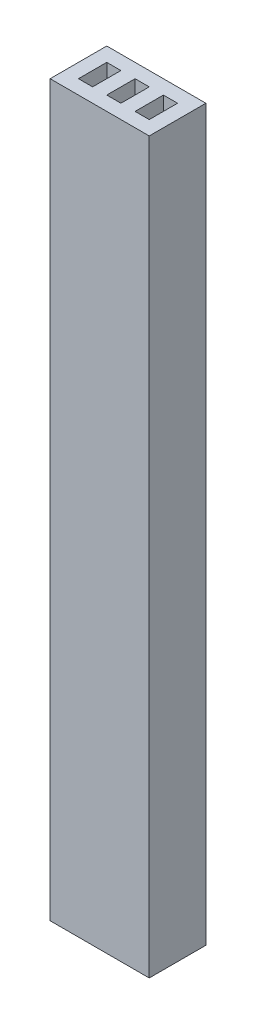
ISO-10303-21;
HEADER;
FILE_DESCRIPTION(('STEP AP214'),'2;1');
FILE_NAME('part.step','',(''),(''),'','','');
FILE_SCHEMA(('AUTOMOTIVE_DESIGN { 1 0 10303 214 1 1 1 1 }'));
ENDSEC;
DATA;
#1=APPLICATION_CONTEXT('core data for automotive mechanical design processes');
#2=APPLICATION_PROTOCOL_DEFINITION('international standard','automotive_design',2000,#1);
#3=PRODUCT_CONTEXT('',#1,'mechanical');
#4=PRODUCT('Part','Part','',(#3));
#5=PRODUCT_RELATED_PRODUCT_CATEGORY('part','',(#4));
#6=PRODUCT_DEFINITION_FORMATION('','',#4);
#7=PRODUCT_DEFINITION_CONTEXT('part definition',#1,'design');
#8=PRODUCT_DEFINITION('design','',#6,#7);
#9=PRODUCT_DEFINITION_SHAPE('','',#8);
#10=(LENGTH_UNIT() NAMED_UNIT(*) SI_UNIT(.MILLI.,.METRE.));
#11=(NAMED_UNIT(*) PLANE_ANGLE_UNIT() SI_UNIT($,.RADIAN.));
#12=(NAMED_UNIT(*) SI_UNIT($,.STERADIAN.) SOLID_ANGLE_UNIT());
#13=UNCERTAINTY_MEASURE_WITH_UNIT(LENGTH_MEASURE(1.E-05),#10,'distance_accuracy_value','');
#14=(GEOMETRIC_REPRESENTATION_CONTEXT(3) GLOBAL_UNCERTAINTY_ASSIGNED_CONTEXT((#13)) GLOBAL_UNIT_ASSIGNED_CONTEXT((#10,
#11,#12)) REPRESENTATION_CONTEXT('',''));
#15=CARTESIAN_POINT('',(0.,0.,0.));
#16=DIRECTION('',(0.,0.,1.));
#17=DIRECTION('',(1.,0.,0.));
#18=AXIS2_PLACEMENT_3D('',#15,#16,#17);
#19=CARTESIAN_POINT('',(0.,51.5,0.));
#20=DIRECTION('',(0.,1.,0.));
#21=DIRECTION('',(0.,0.,1.));
#22=AXIS2_PLACEMENT_3D('',#19,#20,#21);
#23=PLANE('',#22);
#24=DIRECTION('',(0.,0.,-1.));
#25=VECTOR('',#24,1.);
#26=CARTESIAN_POINT('',(6.,51.5,-3.));
#27=LINE('',#26,#25);
#28=CARTESIAN_POINT('',(6.,51.5,1.));
#29=VERTEX_POINT('',#28);
#30=CARTESIAN_POINT('',(6.,51.5,-3.));
#31=VERTEX_POINT('',#30);
#32=EDGE_CURVE('E244',#29,#31,#27,.T.);
#33=ORIENTED_EDGE('',*,*,#32,.T.);
#34=DIRECTION('',(-1.,0.,0.));
#35=VECTOR('',#34,1.);
#36=CARTESIAN_POINT('',(-1.,51.5,-3.));
#37=LINE('',#36,#35);
#38=CARTESIAN_POINT('',(-1.,51.5,-3.));
#39=VERTEX_POINT('',#38);
#40=EDGE_CURVE('E247',#31,#39,#37,.T.);
#41=ORIENTED_EDGE('',*,*,#40,.T.);
#42=DIRECTION('',(0.,0.,1.));
#43=VECTOR('',#42,1.);
#44=CARTESIAN_POINT('',(-1.,51.5,-3.));
#45=LINE('',#44,#43);
#46=CARTESIAN_POINT('',(-1.,51.5,1.));
#47=VERTEX_POINT('',#46);
#48=EDGE_CURVE('E250',#39,#47,#45,.T.);
#49=ORIENTED_EDGE('',*,*,#48,.T.);
#50=DIRECTION('',(1.,0.,0.));
#51=VECTOR('',#50,1.);
#52=CARTESIAN_POINT('',(-1.,51.5,1.));
#53=LINE('',#52,#51);
#54=EDGE_CURVE('E252',#47,#29,#53,.T.);
#55=ORIENTED_EDGE('',*,*,#54,.T.);
#56=EDGE_LOOP('',(#33,#41,#49,#55));
#57=FACE_BOUND('',#56,.T.);
#58=DIRECTION('',(1.,0.,0.));
#59=VECTOR('',#58,1.);
#60=CARTESIAN_POINT('',(0.,51.5,0.));
#61=LINE('',#60,#59);
#62=CARTESIAN_POINT('',(0.,51.5,0.));
#63=VERTEX_POINT('',#62);
#64=CARTESIAN_POINT('',(1.,51.5,0.));
#65=VERTEX_POINT('',#64);
#66=EDGE_CURVE('E215',#63,#65,#61,.T.);
#67=ORIENTED_EDGE('',*,*,#66,.F.);
#68=DIRECTION('',(0.,0.,1.));
#69=VECTOR('',#68,1.);
#70=CARTESIAN_POINT('',(0.,51.5,0.));
#71=LINE('',#70,#69);
#72=CARTESIAN_POINT('',(0.,51.5,-2.));
#73=VERTEX_POINT('',#72);
#74=EDGE_CURVE('E213',#73,#63,#71,.T.);
#75=ORIENTED_EDGE('',*,*,#74,.F.);
#76=DIRECTION('',(-1.,0.,0.));
#77=VECTOR('',#76,1.);
#78=CARTESIAN_POINT('',(0.,51.5,-2.));
#79=LINE('',#78,#77);
#80=CARTESIAN_POINT('',(1.,51.5,-2.));
#81=VERTEX_POINT('',#80);
#82=EDGE_CURVE('E221',#81,#73,#79,.T.);
#83=ORIENTED_EDGE('',*,*,#82,.F.);
#84=DIRECTION('',(0.,0.,-1.));
#85=VECTOR('',#84,1.);
#86=CARTESIAN_POINT('',(1.,51.5,0.));
#87=LINE('',#86,#85);
#88=EDGE_CURVE('E218',#65,#81,#87,.T.);
#89=ORIENTED_EDGE('',*,*,#88,.F.);
#90=EDGE_LOOP('',(#67,#75,#83,#89));
#91=FACE_BOUND('',#90,.T.);
#92=DIRECTION('',(-1.,0.,0.));
#93=VECTOR('',#92,1.);
#94=CARTESIAN_POINT('',(2.,51.5,-2.));
#95=LINE('',#94,#93);
#96=CARTESIAN_POINT('',(3.,51.5,-2.));
#97=VERTEX_POINT('',#96);
#98=CARTESIAN_POINT('',(2.,51.5,-2.));
#99=VERTEX_POINT('',#98);
#100=EDGE_CURVE('E184',#97,#99,#95,.T.);
#101=ORIENTED_EDGE('',*,*,#100,.F.);
#102=DIRECTION('',(0.,0.,-1.));
#103=VECTOR('',#102,1.);
#104=CARTESIAN_POINT('',(3.,51.5,0.));
#105=LINE('',#104,#103);
#106=CARTESIAN_POINT('',(3.,51.5,0.));
#107=VERTEX_POINT('',#106);
#108=EDGE_CURVE('E182',#107,#97,#105,.T.);
#109=ORIENTED_EDGE('',*,*,#108,.F.);
#110=DIRECTION('',(1.,0.,0.));
#111=VECTOR('',#110,1.);
#112=CARTESIAN_POINT('',(2.,51.5,0.));
#113=LINE('',#112,#111);
#114=CARTESIAN_POINT('',(2.,51.5,0.));
#115=VERTEX_POINT('',#114);
#116=EDGE_CURVE('E190',#115,#107,#113,.T.);
#117=ORIENTED_EDGE('',*,*,#116,.F.);
#118=DIRECTION('',(0.,0.,1.));
#119=VECTOR('',#118,1.);
#120=CARTESIAN_POINT('',(2.,51.5,0.));
#121=LINE('',#120,#119);
#122=EDGE_CURVE('E187',#99,#115,#121,.T.);
#123=ORIENTED_EDGE('',*,*,#122,.F.);
#124=EDGE_LOOP('',(#101,#109,#117,#123));
#125=FACE_BOUND('',#124,.T.);
#126=DIRECTION('',(-1.,0.,0.));
#127=VECTOR('',#126,1.);
#128=CARTESIAN_POINT('',(4.,51.5,-2.));
#129=LINE('',#128,#127);
#130=CARTESIAN_POINT('',(5.,51.5,-2.));
#131=VERTEX_POINT('',#130);
#132=CARTESIAN_POINT('',(4.,51.5,-2.));
#133=VERTEX_POINT('',#132);
#134=EDGE_CURVE('E154',#131,#133,#129,.T.);
#135=ORIENTED_EDGE('',*,*,#134,.F.);
#136=DIRECTION('',(0.,0.,-1.));
#137=VECTOR('',#136,1.);
#138=CARTESIAN_POINT('',(5.,51.5,0.));
#139=LINE('',#138,#137);
#140=CARTESIAN_POINT('',(5.,51.5,0.));
#141=VERTEX_POINT('',#140);
#142=EDGE_CURVE('E146',#141,#131,#139,.T.);
#143=ORIENTED_EDGE('',*,*,#142,.F.);
#144=DIRECTION('',(1.,0.,0.));
#145=VECTOR('',#144,1.);
#146=CARTESIAN_POINT('',(4.,51.5,0.));
#147=LINE('',#146,#145);
#148=CARTESIAN_POINT('',(4.,51.5,0.));
#149=VERTEX_POINT('',#148);
#150=EDGE_CURVE('E168',#149,#141,#147,.T.);
#151=ORIENTED_EDGE('',*,*,#150,.F.);
#152=DIRECTION('',(0.,0.,1.));
#153=VECTOR('',#152,1.);
#154=CARTESIAN_POINT('',(4.,51.5,0.));
#155=LINE('',#154,#153);
#156=EDGE_CURVE('E166',#133,#149,#155,.T.);
#157=ORIENTED_EDGE('',*,*,#156,.F.);
#158=EDGE_LOOP('',(#135,#143,#151,#157));
#159=FACE_BOUND('',#158,.T.);
#160=ADVANCED_FACE('F33',(#57,#91,#125,#159),#23,.T.);
#161=CARTESIAN_POINT('',(0.,0.,0.));
#162=DIRECTION('',(0.,1.,0.));
#163=DIRECTION('',(0.,0.,1.));
#164=AXIS2_PLACEMENT_3D('',#161,#162,#163);
#165=PLANE('',#164);
#166=DIRECTION('',(0.,0.,-1.));
#167=VECTOR('',#166,1.);
#168=CARTESIAN_POINT('',(3.,0.,0.));
#169=LINE('',#168,#167);
#170=CARTESIAN_POINT('',(3.,0.,0.));
#171=VERTEX_POINT('',#170);
#172=CARTESIAN_POINT('',(3.,0.,-2.));
#173=VERTEX_POINT('',#172);
#174=EDGE_CURVE('E162',#171,#173,#169,.T.);
#175=ORIENTED_EDGE('',*,*,#174,.T.);
#176=DIRECTION('',(-1.,0.,0.));
#177=VECTOR('',#176,1.);
#178=CARTESIAN_POINT('',(2.,0.,-2.));
#179=LINE('',#178,#177);
#180=CARTESIAN_POINT('',(2.,0.,-2.));
#181=VERTEX_POINT('',#180);
#182=EDGE_CURVE('E195',#173,#181,#179,.T.);
#183=ORIENTED_EDGE('',*,*,#182,.T.);
#184=DIRECTION('',(0.,0.,1.));
#185=VECTOR('',#184,1.);
#186=CARTESIAN_POINT('',(2.,0.,0.));
#187=LINE('',#186,#185);
#188=CARTESIAN_POINT('',(2.,0.,0.));
#189=VERTEX_POINT('',#188);
#190=EDGE_CURVE('E198',#181,#189,#187,.T.);
#191=ORIENTED_EDGE('',*,*,#190,.T.);
#192=DIRECTION('',(1.,0.,0.));
#193=VECTOR('',#192,1.);
#194=CARTESIAN_POINT('',(2.,0.,0.));
#195=LINE('',#194,#193);
#196=EDGE_CURVE('E185',#189,#171,#195,.T.);
#197=ORIENTED_EDGE('',*,*,#196,.T.);
#198=EDGE_LOOP('',(#175,#183,#191,#197));
#199=FACE_BOUND('',#198,.T.);
#200=DIRECTION('',(0.,0.,-1.));
#201=VECTOR('',#200,1.);
#202=CARTESIAN_POINT('',(6.,0.,-3.));
#203=LINE('',#202,#201);
#204=CARTESIAN_POINT('',(6.,0.,1.));
#205=VERTEX_POINT('',#204);
#206=CARTESIAN_POINT('',(6.,0.,-3.));
#207=VERTEX_POINT('',#206);
#208=EDGE_CURVE('E243',#205,#207,#203,.T.);
#209=ORIENTED_EDGE('',*,*,#208,.F.);
#210=DIRECTION('',(1.,0.,0.));
#211=VECTOR('',#210,1.);
#212=CARTESIAN_POINT('',(-1.,0.,1.));
#213=LINE('',#212,#211);
#214=CARTESIAN_POINT('',(-1.,0.,1.));
#215=VERTEX_POINT('',#214);
#216=EDGE_CURVE('E248',#215,#205,#213,.T.);
#217=ORIENTED_EDGE('',*,*,#216,.F.);
#218=DIRECTION('',(0.,0.,1.));
#219=VECTOR('',#218,1.);
#220=CARTESIAN_POINT('',(-1.,0.,-3.));
#221=LINE('',#220,#219);
#222=CARTESIAN_POINT('',(-1.,0.,-3.));
#223=VERTEX_POINT('',#222);
#224=EDGE_CURVE('E259',#223,#215,#221,.T.);
#225=ORIENTED_EDGE('',*,*,#224,.F.);
#226=DIRECTION('',(-1.,0.,0.));
#227=VECTOR('',#226,1.);
#228=CARTESIAN_POINT('',(-1.,0.,-3.));
#229=LINE('',#228,#227);
#230=EDGE_CURVE('E257',#207,#223,#229,.T.);
#231=ORIENTED_EDGE('',*,*,#230,.F.);
#232=EDGE_LOOP('',(#209,#217,#225,#231));
#233=FACE_BOUND('',#232,.T.);
#234=DIRECTION('',(0.,0.,1.));
#235=VECTOR('',#234,1.);
#236=CARTESIAN_POINT('',(0.,0.,0.));
#237=LINE('',#236,#235);
#238=CARTESIAN_POINT('',(0.,0.,-2.));
#239=VERTEX_POINT('',#238);
#240=CARTESIAN_POINT('',(0.,0.,0.));
#241=VERTEX_POINT('',#240);
#242=EDGE_CURVE('E212',#239,#241,#237,.T.);
#243=ORIENTED_EDGE('',*,*,#242,.T.);
#244=DIRECTION('',(1.,0.,0.));
#245=VECTOR('',#244,1.);
#246=CARTESIAN_POINT('',(0.,0.,0.));
#247=LINE('',#246,#245);
#248=CARTESIAN_POINT('',(1.,0.,0.));
#249=VERTEX_POINT('',#248);
#250=EDGE_CURVE('E226',#241,#249,#247,.T.);
#251=ORIENTED_EDGE('',*,*,#250,.T.);
#252=DIRECTION('',(0.,0.,-1.));
#253=VECTOR('',#252,1.);
#254=CARTESIAN_POINT('',(1.,0.,0.));
#255=LINE('',#254,#253);
#256=CARTESIAN_POINT('',(1.,0.,-2.));
#257=VERTEX_POINT('',#256);
#258=EDGE_CURVE('E229',#249,#257,#255,.T.);
#259=ORIENTED_EDGE('',*,*,#258,.T.);
#260=DIRECTION('',(-1.,0.,0.));
#261=VECTOR('',#260,1.);
#262=CARTESIAN_POINT('',(0.,0.,-2.));
#263=LINE('',#262,#261);
#264=EDGE_CURVE('E216',#257,#239,#263,.T.);
#265=ORIENTED_EDGE('',*,*,#264,.T.);
#266=EDGE_LOOP('',(#243,#251,#259,#265));
#267=FACE_BOUND('',#266,.T.);
#268=DIRECTION('',(0.,0.,-1.));
#269=VECTOR('',#268,1.);
#270=CARTESIAN_POINT('',(5.,0.,0.));
#271=LINE('',#270,#269);
#272=CARTESIAN_POINT('',(5.,0.,0.));
#273=VERTEX_POINT('',#272);
#274=CARTESIAN_POINT('',(5.,0.,-2.));
#275=VERTEX_POINT('',#274);
#276=EDGE_CURVE('E56',#273,#275,#271,.T.);
#277=ORIENTED_EDGE('',*,*,#276,.T.);
#278=DIRECTION('',(-1.,0.,0.));
#279=VECTOR('',#278,1.);
#280=CARTESIAN_POINT('',(4.,0.,-2.));
#281=LINE('',#280,#279);
#282=CARTESIAN_POINT('',(4.,0.,-2.));
#283=VERTEX_POINT('',#282);
#284=EDGE_CURVE('E161',#275,#283,#281,.T.);
#285=ORIENTED_EDGE('',*,*,#284,.T.);
#286=DIRECTION('',(0.,0.,1.));
#287=VECTOR('',#286,1.);
#288=CARTESIAN_POINT('',(4.,0.,0.));
#289=LINE('',#288,#287);
#290=CARTESIAN_POINT('',(4.,0.,0.));
#291=VERTEX_POINT('',#290);
#292=EDGE_CURVE('E174',#283,#291,#289,.T.);
#293=ORIENTED_EDGE('',*,*,#292,.T.);
#294=DIRECTION('',(1.,0.,0.));
#295=VECTOR('',#294,1.);
#296=CARTESIAN_POINT('',(4.,0.,0.));
#297=LINE('',#296,#295);
#298=EDGE_CURVE('E155',#291,#273,#297,.T.);
#299=ORIENTED_EDGE('',*,*,#298,.T.);
#300=EDGE_LOOP('',(#277,#285,#293,#299));
#301=FACE_BOUND('',#300,.T.);
#302=ADVANCED_FACE('F277',(#199,#233,#267,#301),#165,.F.);
#303=CARTESIAN_POINT('',(6.,51.5,-3.));
#304=DIRECTION('',(-1.,0.,0.));
#305=DIRECTION('',(0.,0.,1.));
#306=AXIS2_PLACEMENT_3D('',#303,#304,#305);
#307=PLANE('',#306);
#308=ORIENTED_EDGE('',*,*,#208,.T.);
#309=DIRECTION('',(0.,-1.,0.));
#310=VECTOR('',#309,1.);
#311=CARTESIAN_POINT('',(6.,51.5,-3.));
#312=LINE('',#311,#310);
#313=EDGE_CURVE('E11',#31,#207,#312,.T.);
#314=ORIENTED_EDGE('',*,*,#313,.F.);
#315=ORIENTED_EDGE('',*,*,#32,.F.);
#316=DIRECTION('',(0.,-1.,0.));
#317=VECTOR('',#316,1.);
#318=CARTESIAN_POINT('',(6.,51.5,1.));
#319=LINE('',#318,#317);
#320=EDGE_CURVE('E254',#29,#205,#319,.T.);
#321=ORIENTED_EDGE('',*,*,#320,.T.);
#322=EDGE_LOOP('',(#308,#314,#315,#321));
#323=FACE_BOUND('',#322,.T.);
#324=ADVANCED_FACE('F35',(#323),#307,.F.);
#325=CARTESIAN_POINT('',(-1.,51.5,-3.));
#326=DIRECTION('',(0.,0.,1.));
#327=DIRECTION('',(1.,0.,0.));
#328=AXIS2_PLACEMENT_3D('',#325,#326,#327);
#329=PLANE('',#328);
#330=ORIENTED_EDGE('',*,*,#230,.T.);
#331=DIRECTION('',(0.,-1.,0.));
#332=VECTOR('',#331,1.);
#333=CARTESIAN_POINT('',(-1.,51.5,-3.));
#334=LINE('',#333,#332);
#335=EDGE_CURVE('E41',#39,#223,#334,.T.);
#336=ORIENTED_EDGE('',*,*,#335,.F.);
#337=ORIENTED_EDGE('',*,*,#40,.F.);
#338=ORIENTED_EDGE('',*,*,#313,.T.);
#339=EDGE_LOOP('',(#330,#336,#337,#338));
#340=FACE_BOUND('',#339,.T.);
#341=ADVANCED_FACE('F288',(#340),#329,.F.);
#342=CARTESIAN_POINT('',(-1.,51.5,-3.));
#343=DIRECTION('',(1.,0.,0.));
#344=DIRECTION('',(0.,0.,-1.));
#345=AXIS2_PLACEMENT_3D('',#342,#343,#344);
#346=PLANE('',#345);
#347=ORIENTED_EDGE('',*,*,#224,.T.);
#348=DIRECTION('',(0.,-1.,0.));
#349=VECTOR('',#348,1.);
#350=CARTESIAN_POINT('',(-1.,51.5,1.));
#351=LINE('',#350,#349);
#352=EDGE_CURVE('E264',#47,#215,#351,.T.);
#353=ORIENTED_EDGE('',*,*,#352,.F.);
#354=ORIENTED_EDGE('',*,*,#48,.F.);
#355=ORIENTED_EDGE('',*,*,#335,.T.);
#356=EDGE_LOOP('',(#347,#353,#354,#355));
#357=FACE_BOUND('',#356,.T.);
#358=ADVANCED_FACE('F271',(#357),#346,.F.);
#359=CARTESIAN_POINT('',(-1.,51.5,1.));
#360=DIRECTION('',(0.,0.,-1.));
#361=DIRECTION('',(-1.,0.,0.));
#362=AXIS2_PLACEMENT_3D('',#359,#360,#361);
#363=PLANE('',#362);
#364=ORIENTED_EDGE('',*,*,#216,.T.);
#365=ORIENTED_EDGE('',*,*,#320,.F.);
#366=ORIENTED_EDGE('',*,*,#54,.F.);
#367=ORIENTED_EDGE('',*,*,#352,.T.);
#368=EDGE_LOOP('',(#364,#365,#366,#367));
#369=FACE_BOUND('',#368,.T.);
#370=ADVANCED_FACE('F281',(#369),#363,.F.);
#371=CARTESIAN_POINT('',(0.,51.5,0.));
#372=DIRECTION('',(1.,0.,0.));
#373=DIRECTION('',(0.,0.,-1.));
#374=AXIS2_PLACEMENT_3D('',#371,#372,#373);
#375=PLANE('',#374);
#376=ORIENTED_EDGE('',*,*,#242,.F.);
#377=DIRECTION('',(0.,-1.,0.));
#378=VECTOR('',#377,1.);
#379=CARTESIAN_POINT('',(0.,51.5,-2.));
#380=LINE('',#379,#378);
#381=EDGE_CURVE('E223',#73,#239,#380,.T.);
#382=ORIENTED_EDGE('',*,*,#381,.F.);
#383=ORIENTED_EDGE('',*,*,#74,.T.);
#384=DIRECTION('',(0.,-1.,0.));
#385=VECTOR('',#384,1.);
#386=CARTESIAN_POINT('',(0.,51.5,0.));
#387=LINE('',#386,#385);
#388=EDGE_CURVE('E240',#63,#241,#387,.T.);
#389=ORIENTED_EDGE('',*,*,#388,.T.);
#390=EDGE_LOOP('',(#376,#382,#383,#389));
#391=FACE_BOUND('',#390,.T.);
#392=ADVANCED_FACE('F303',(#391),#375,.T.);
#393=CARTESIAN_POINT('',(0.,51.5,0.));
#394=DIRECTION('',(0.,0.,-1.));
#395=DIRECTION('',(-1.,0.,0.));
#396=AXIS2_PLACEMENT_3D('',#393,#394,#395);
#397=PLANE('',#396);
#398=ORIENTED_EDGE('',*,*,#250,.F.);
#399=ORIENTED_EDGE('',*,*,#388,.F.);
#400=ORIENTED_EDGE('',*,*,#66,.T.);
#401=DIRECTION('',(0.,-1.,0.));
#402=VECTOR('',#401,1.);
#403=CARTESIAN_POINT('',(1.,51.5,0.));
#404=LINE('',#403,#402);
#405=EDGE_CURVE('E238',#65,#249,#404,.T.);
#406=ORIENTED_EDGE('',*,*,#405,.T.);
#407=EDGE_LOOP('',(#398,#399,#400,#406));
#408=FACE_BOUND('',#407,.T.);
#409=ADVANCED_FACE('F310',(#408),#397,.T.);
#410=CARTESIAN_POINT('',(1.,51.5,0.));
#411=DIRECTION('',(-1.,0.,0.));
#412=DIRECTION('',(0.,0.,1.));
#413=AXIS2_PLACEMENT_3D('',#410,#411,#412);
#414=PLANE('',#413);
#415=ORIENTED_EDGE('',*,*,#258,.F.);
#416=ORIENTED_EDGE('',*,*,#405,.F.);
#417=ORIENTED_EDGE('',*,*,#88,.T.);
#418=DIRECTION('',(0.,-1.,0.));
#419=VECTOR('',#418,1.);
#420=CARTESIAN_POINT('',(1.,51.5,-2.));
#421=LINE('',#420,#419);
#422=EDGE_CURVE('E236',#81,#257,#421,.T.);
#423=ORIENTED_EDGE('',*,*,#422,.T.);
#424=EDGE_LOOP('',(#415,#416,#417,#423));
#425=FACE_BOUND('',#424,.T.);
#426=ADVANCED_FACE('F315',(#425),#414,.T.);
#427=CARTESIAN_POINT('',(0.,51.5,-2.));
#428=DIRECTION('',(0.,0.,1.));
#429=DIRECTION('',(1.,0.,0.));
#430=AXIS2_PLACEMENT_3D('',#427,#428,#429);
#431=PLANE('',#430);
#432=ORIENTED_EDGE('',*,*,#264,.F.);
#433=ORIENTED_EDGE('',*,*,#422,.F.);
#434=ORIENTED_EDGE('',*,*,#82,.T.);
#435=ORIENTED_EDGE('',*,*,#381,.T.);
#436=EDGE_LOOP('',(#432,#433,#434,#435));
#437=FACE_BOUND('',#436,.T.);
#438=ADVANCED_FACE('F322',(#437),#431,.T.);
#439=CARTESIAN_POINT('',(3.,51.5,0.));
#440=DIRECTION('',(-1.,0.,0.));
#441=DIRECTION('',(0.,0.,1.));
#442=AXIS2_PLACEMENT_3D('',#439,#440,#441);
#443=PLANE('',#442);
#444=ORIENTED_EDGE('',*,*,#174,.F.);
#445=DIRECTION('',(0.,-1.,0.));
#446=VECTOR('',#445,1.);
#447=CARTESIAN_POINT('',(3.,51.5,0.));
#448=LINE('',#447,#446);
#449=EDGE_CURVE('E192',#107,#171,#448,.T.);
#450=ORIENTED_EDGE('',*,*,#449,.F.);
#451=ORIENTED_EDGE('',*,*,#108,.T.);
#452=DIRECTION('',(0.,-1.,0.));
#453=VECTOR('',#452,1.);
#454=CARTESIAN_POINT('',(3.,51.5,-2.));
#455=LINE('',#454,#453);
#456=EDGE_CURVE('E209',#97,#173,#455,.T.);
#457=ORIENTED_EDGE('',*,*,#456,.T.);
#458=EDGE_LOOP('',(#444,#450,#451,#457));
#459=FACE_BOUND('',#458,.T.);
#460=ADVANCED_FACE('F344',(#459),#443,.T.);
#461=CARTESIAN_POINT('',(2.,51.5,-2.));
#462=DIRECTION('',(0.,0.,1.));
#463=DIRECTION('',(1.,0.,0.));
#464=AXIS2_PLACEMENT_3D('',#461,#462,#463);
#465=PLANE('',#464);
#466=ORIENTED_EDGE('',*,*,#182,.F.);
#467=ORIENTED_EDGE('',*,*,#456,.F.);
#468=ORIENTED_EDGE('',*,*,#100,.T.);
#469=DIRECTION('',(0.,-1.,0.));
#470=VECTOR('',#469,1.);
#471=CARTESIAN_POINT('',(2.,51.5,-2.));
#472=LINE('',#471,#470);
#473=EDGE_CURVE('E207',#99,#181,#472,.T.);
#474=ORIENTED_EDGE('',*,*,#473,.T.);
#475=EDGE_LOOP('',(#466,#467,#468,#474));
#476=FACE_BOUND('',#475,.T.);
#477=ADVANCED_FACE('F338',(#476),#465,.T.);
#478=CARTESIAN_POINT('',(2.,51.5,0.));
#479=DIRECTION('',(1.,0.,0.));
#480=DIRECTION('',(0.,0.,-1.));
#481=AXIS2_PLACEMENT_3D('',#478,#479,#480);
#482=PLANE('',#481);
#483=ORIENTED_EDGE('',*,*,#190,.F.);
#484=ORIENTED_EDGE('',*,*,#473,.F.);
#485=ORIENTED_EDGE('',*,*,#122,.T.);
#486=DIRECTION('',(0.,-1.,0.));
#487=VECTOR('',#486,1.);
#488=CARTESIAN_POINT('',(2.,51.5,0.));
#489=LINE('',#488,#487);
#490=EDGE_CURVE('E205',#115,#189,#489,.T.);
#491=ORIENTED_EDGE('',*,*,#490,.T.);
#492=EDGE_LOOP('',(#483,#484,#485,#491));
#493=FACE_BOUND('',#492,.T.);
#494=ADVANCED_FACE('F341',(#493),#482,.T.);
#495=CARTESIAN_POINT('',(2.,51.5,0.));
#496=DIRECTION('',(0.,0.,-1.));
#497=DIRECTION('',(-1.,0.,0.));
#498=AXIS2_PLACEMENT_3D('',#495,#496,#497);
#499=PLANE('',#498);
#500=ORIENTED_EDGE('',*,*,#196,.F.);
#501=ORIENTED_EDGE('',*,*,#490,.F.);
#502=ORIENTED_EDGE('',*,*,#116,.T.);
#503=ORIENTED_EDGE('',*,*,#449,.T.);
#504=EDGE_LOOP('',(#500,#501,#502,#503));
#505=FACE_BOUND('',#504,.T.);
#506=ADVANCED_FACE('F347',(#505),#499,.T.);
#507=CARTESIAN_POINT('',(5.,51.5,0.));
#508=DIRECTION('',(-1.,0.,0.));
#509=DIRECTION('',(0.,0.,1.));
#510=AXIS2_PLACEMENT_3D('',#507,#508,#509);
#511=PLANE('',#510);
#512=ORIENTED_EDGE('',*,*,#276,.F.);
#513=DIRECTION('',(0.,-1.,0.));
#514=VECTOR('',#513,1.);
#515=CARTESIAN_POINT('',(5.,51.5,0.));
#516=LINE('',#515,#514);
#517=EDGE_CURVE('E150',#141,#273,#516,.T.);
#518=ORIENTED_EDGE('',*,*,#517,.F.);
#519=ORIENTED_EDGE('',*,*,#142,.T.);
#520=DIRECTION('',(0.,-1.,0.));
#521=VECTOR('',#520,1.);
#522=CARTESIAN_POINT('',(5.,51.5,-2.));
#523=LINE('',#522,#521);
#524=EDGE_CURVE('E149',#131,#275,#523,.T.);
#525=ORIENTED_EDGE('',*,*,#524,.T.);
#526=EDGE_LOOP('',(#512,#518,#519,#525));
#527=FACE_BOUND('',#526,.T.);
#528=ADVANCED_FACE('F148',(#527),#511,.T.);
#529=CARTESIAN_POINT('',(4.,51.5,-2.));
#530=DIRECTION('',(0.,0.,1.));
#531=DIRECTION('',(1.,0.,0.));
#532=AXIS2_PLACEMENT_3D('',#529,#530,#531);
#533=PLANE('',#532);
#534=ORIENTED_EDGE('',*,*,#284,.F.);
#535=ORIENTED_EDGE('',*,*,#524,.F.);
#536=ORIENTED_EDGE('',*,*,#134,.T.);
#537=DIRECTION('',(0.,-1.,0.));
#538=VECTOR('',#537,1.);
#539=CARTESIAN_POINT('',(4.,51.5,-2.));
#540=LINE('',#539,#538);
#541=EDGE_CURVE('E163',#133,#283,#540,.T.);
#542=ORIENTED_EDGE('',*,*,#541,.T.);
#543=EDGE_LOOP('',(#534,#535,#536,#542));
#544=FACE_BOUND('',#543,.T.);
#545=ADVANCED_FACE('F158',(#544),#533,.T.);
#546=CARTESIAN_POINT('',(4.,51.5,0.));
#547=DIRECTION('',(1.,0.,0.));
#548=DIRECTION('',(0.,0.,-1.));
#549=AXIS2_PLACEMENT_3D('',#546,#547,#548);
#550=PLANE('',#549);
#551=ORIENTED_EDGE('',*,*,#292,.F.);
#552=ORIENTED_EDGE('',*,*,#541,.F.);
#553=ORIENTED_EDGE('',*,*,#156,.T.);
#554=DIRECTION('',(0.,-1.,0.));
#555=VECTOR('',#554,1.);
#556=CARTESIAN_POINT('',(4.,51.5,0.));
#557=LINE('',#556,#555);
#558=EDGE_CURVE('E48',#149,#291,#557,.T.);
#559=ORIENTED_EDGE('',*,*,#558,.T.);
#560=EDGE_LOOP('',(#551,#552,#553,#559));
#561=FACE_BOUND('',#560,.T.);
#562=ADVANCED_FACE('F404',(#561),#550,.T.);
#563=CARTESIAN_POINT('',(4.,51.5,0.));
#564=DIRECTION('',(0.,0.,-1.));
#565=DIRECTION('',(-1.,0.,0.));
#566=AXIS2_PLACEMENT_3D('',#563,#564,#565);
#567=PLANE('',#566);
#568=ORIENTED_EDGE('',*,*,#298,.F.);
#569=ORIENTED_EDGE('',*,*,#558,.F.);
#570=ORIENTED_EDGE('',*,*,#150,.T.);
#571=ORIENTED_EDGE('',*,*,#517,.T.);
#572=EDGE_LOOP('',(#568,#569,#570,#571));
#573=FACE_BOUND('',#572,.T.);
#574=ADVANCED_FACE('F412',(#573),#567,.T.);
#575=CLOSED_SHELL('',(#160,#302,#324,#341,#358,#370,#392,#409,#426,#438,#460,#477,#494,#506,
#528,#545,#562,#574));
#576=MANIFOLD_SOLID_BREP('B2',#575);
#577=ADVANCED_BREP_SHAPE_REPRESENTATION('',(#18,#576),#14);
#578=SHAPE_DEFINITION_REPRESENTATION(#9,#577);
ENDSEC;
END-ISO-10303-21;
